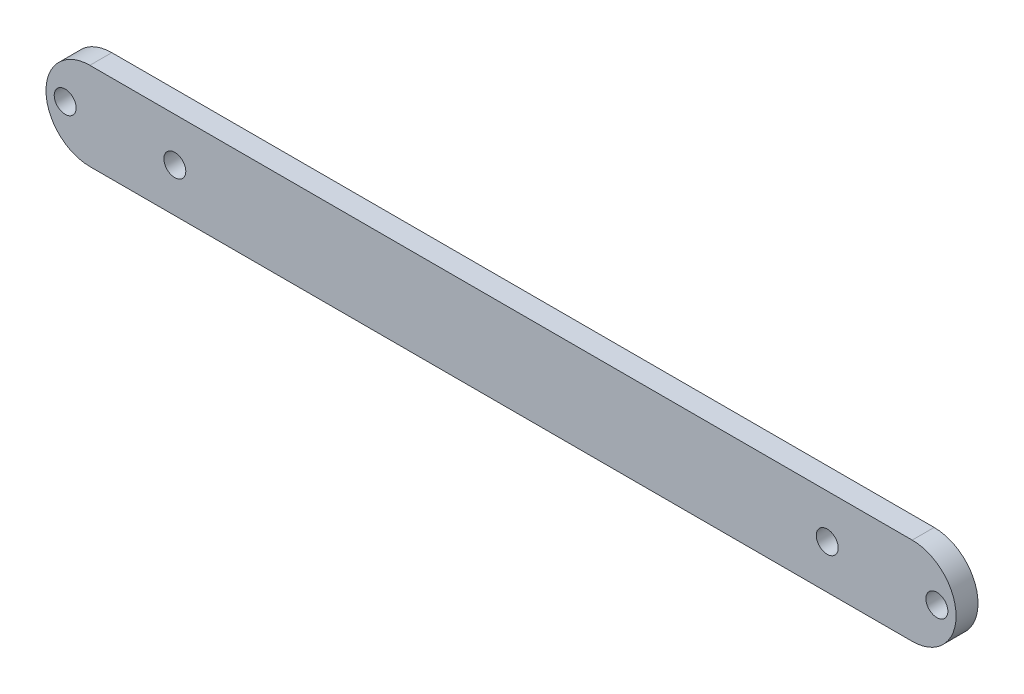
ISO-10303-21;
HEADER;
FILE_DESCRIPTION(('STEP AP214'),'2;1');
FILE_NAME('part.step','',(''),(''),'','','');
FILE_SCHEMA(('AUTOMOTIVE_DESIGN { 1 0 10303 214 1 1 1 1 }'));
ENDSEC;
DATA;
#1=APPLICATION_CONTEXT('core data for automotive mechanical design processes');
#2=APPLICATION_PROTOCOL_DEFINITION('international standard','automotive_design',2000,#1);
#3=PRODUCT_CONTEXT('',#1,'mechanical');
#4=PRODUCT('Part','Part','',(#3));
#5=PRODUCT_RELATED_PRODUCT_CATEGORY('part','',(#4));
#6=PRODUCT_DEFINITION_FORMATION('','',#4);
#7=PRODUCT_DEFINITION_CONTEXT('part definition',#1,'design');
#8=PRODUCT_DEFINITION('design','',#6,#7);
#9=PRODUCT_DEFINITION_SHAPE('','',#8);
#10=(LENGTH_UNIT() NAMED_UNIT(*) SI_UNIT(.MILLI.,.METRE.));
#11=(NAMED_UNIT(*) PLANE_ANGLE_UNIT() SI_UNIT($,.RADIAN.));
#12=(NAMED_UNIT(*) SI_UNIT($,.STERADIAN.) SOLID_ANGLE_UNIT());
#13=UNCERTAINTY_MEASURE_WITH_UNIT(LENGTH_MEASURE(1.E-05),#10,'distance_accuracy_value','');
#14=(GEOMETRIC_REPRESENTATION_CONTEXT(3) GLOBAL_UNCERTAINTY_ASSIGNED_CONTEXT((#13)) GLOBAL_UNIT_ASSIGNED_CONTEXT((#10,
#11,#12)) REPRESENTATION_CONTEXT('',''));
#15=CARTESIAN_POINT('',(0.,0.,0.));
#16=DIRECTION('',(0.,0.,1.));
#17=DIRECTION('',(1.,0.,0.));
#18=AXIS2_PLACEMENT_3D('',#15,#16,#17);
#19=CARTESIAN_POINT('',(0.,0.,4.));
#20=DIRECTION('',(0.,0.,-1.));
#21=DIRECTION('',(-1.,0.,0.));
#22=AXIS2_PLACEMENT_3D('',#19,#20,#21);
#23=CYLINDRICAL_SURFACE('',#22,8.);
#24=CARTESIAN_POINT('',(0.,0.,0.));
#25=DIRECTION('',(0.,0.,1.));
#26=DIRECTION('',(1.,0.,0.));
#27=AXIS2_PLACEMENT_3D('',#24,#25,#26);
#28=CIRCLE('',#27,8.);
#29=CARTESIAN_POINT('',(0.,8.,0.));
#30=VERTEX_POINT('',#29);
#31=CARTESIAN_POINT('',(0.,-8.,0.));
#32=VERTEX_POINT('',#31);
#33=EDGE_CURVE('E103',#30,#32,#28,.T.);
#34=ORIENTED_EDGE('',*,*,#33,.T.);
#35=DIRECTION('',(0.,0.,-1.));
#36=VECTOR('',#35,1.);
#37=CARTESIAN_POINT('',(0.,-8.,4.));
#38=LINE('',#37,#36);
#39=CARTESIAN_POINT('',(0.,-8.,4.));
#40=VERTEX_POINT('',#39);
#41=EDGE_CURVE('E11',#40,#32,#38,.T.);
#42=ORIENTED_EDGE('',*,*,#41,.F.);
#43=CARTESIAN_POINT('',(0.,0.,4.));
#44=DIRECTION('',(0.,0.,1.));
#45=DIRECTION('',(1.,0.,0.));
#46=AXIS2_PLACEMENT_3D('',#43,#44,#45);
#47=CIRCLE('',#46,8.);
#48=CARTESIAN_POINT('',(0.,8.,4.));
#49=VERTEX_POINT('',#48);
#50=EDGE_CURVE('E90',#49,#40,#47,.T.);
#51=ORIENTED_EDGE('',*,*,#50,.F.);
#52=DIRECTION('',(0.,0.,-1.));
#53=VECTOR('',#52,1.);
#54=CARTESIAN_POINT('',(0.,8.,4.));
#55=LINE('',#54,#53);
#56=EDGE_CURVE('E99',#49,#30,#55,.T.);
#57=ORIENTED_EDGE('',*,*,#56,.T.);
#58=EDGE_LOOP('',(#34,#42,#51,#57));
#59=FACE_BOUND('',#58,.T.);
#60=ADVANCED_FACE('F37',(#59),#23,.T.);
#61=CARTESIAN_POINT('',(0.,-8.,4.));
#62=DIRECTION('',(0.,1.,0.));
#63=DIRECTION('',(0.,0.,1.));
#64=AXIS2_PLACEMENT_3D('',#61,#62,#63);
#65=PLANE('',#64);
#66=DIRECTION('',(1.,0.,0.));
#67=VECTOR('',#66,1.);
#68=CARTESIAN_POINT('',(0.,-8.,0.));
#69=LINE('',#68,#67);
#70=CARTESIAN_POINT('',(150.,-8.,0.));
#71=VERTEX_POINT('',#70);
#72=EDGE_CURVE('E94',#32,#71,#69,.T.);
#73=ORIENTED_EDGE('',*,*,#72,.T.);
#74=DIRECTION('',(0.,0.,-1.));
#75=VECTOR('',#74,1.);
#76=CARTESIAN_POINT('',(150.,-8.,4.));
#77=LINE('',#76,#75);
#78=CARTESIAN_POINT('',(150.,-8.,4.));
#79=VERTEX_POINT('',#78);
#80=EDGE_CURVE('E46',#79,#71,#77,.T.);
#81=ORIENTED_EDGE('',*,*,#80,.F.);
#82=DIRECTION('',(1.,0.,0.));
#83=VECTOR('',#82,1.);
#84=CARTESIAN_POINT('',(0.,-8.,4.));
#85=LINE('',#84,#83);
#86=EDGE_CURVE('E85',#40,#79,#85,.T.);
#87=ORIENTED_EDGE('',*,*,#86,.F.);
#88=ORIENTED_EDGE('',*,*,#41,.T.);
#89=EDGE_LOOP('',(#73,#81,#87,#88));
#90=FACE_BOUND('',#89,.T.);
#91=ADVANCED_FACE('F93',(#90),#65,.F.);
#92=CARTESIAN_POINT('',(150.,0.,4.));
#93=DIRECTION('',(0.,0.,-1.));
#94=DIRECTION('',(-1.,0.,0.));
#95=AXIS2_PLACEMENT_3D('',#92,#93,#94);
#96=CYLINDRICAL_SURFACE('',#95,8.);
#97=CARTESIAN_POINT('',(150.,0.,0.));
#98=DIRECTION('',(0.,0.,1.));
#99=DIRECTION('',(1.,0.,0.));
#100=AXIS2_PLACEMENT_3D('',#97,#98,#99);
#101=CIRCLE('',#100,8.);
#102=CARTESIAN_POINT('',(150.,8.,0.));
#103=VERTEX_POINT('',#102);
#104=EDGE_CURVE('E72',#71,#103,#101,.T.);
#105=ORIENTED_EDGE('',*,*,#104,.T.);
#106=DIRECTION('',(0.,0.,-1.));
#107=VECTOR('',#106,1.);
#108=CARTESIAN_POINT('',(150.,8.,4.));
#109=LINE('',#108,#107);
#110=CARTESIAN_POINT('',(150.,8.,4.));
#111=VERTEX_POINT('',#110);
#112=EDGE_CURVE('E95',#111,#103,#109,.T.);
#113=ORIENTED_EDGE('',*,*,#112,.F.);
#114=CARTESIAN_POINT('',(150.,0.,4.));
#115=DIRECTION('',(0.,0.,1.));
#116=DIRECTION('',(1.,0.,0.));
#117=AXIS2_PLACEMENT_3D('',#114,#115,#116);
#118=CIRCLE('',#117,8.);
#119=EDGE_CURVE('E88',#79,#111,#118,.T.);
#120=ORIENTED_EDGE('',*,*,#119,.F.);
#121=ORIENTED_EDGE('',*,*,#80,.T.);
#122=EDGE_LOOP('',(#105,#113,#120,#121));
#123=FACE_BOUND('',#122,.T.);
#124=ADVANCED_FACE('F97',(#123),#96,.T.);
#125=CARTESIAN_POINT('',(0.,8.,4.));
#126=DIRECTION('',(0.,-1.,0.));
#127=DIRECTION('',(0.,0.,-1.));
#128=AXIS2_PLACEMENT_3D('',#125,#126,#127);
#129=PLANE('',#128);
#130=DIRECTION('',(-1.,0.,0.));
#131=VECTOR('',#130,1.);
#132=CARTESIAN_POINT('',(0.,8.,0.));
#133=LINE('',#132,#131);
#134=EDGE_CURVE('E78',#103,#30,#133,.T.);
#135=ORIENTED_EDGE('',*,*,#134,.T.);
#136=ORIENTED_EDGE('',*,*,#56,.F.);
#137=DIRECTION('',(-1.,0.,0.));
#138=VECTOR('',#137,1.);
#139=CARTESIAN_POINT('',(0.,8.,4.));
#140=LINE('',#139,#138);
#141=EDGE_CURVE('E55',#111,#49,#140,.T.);
#142=ORIENTED_EDGE('',*,*,#141,.F.);
#143=ORIENTED_EDGE('',*,*,#112,.T.);
#144=EDGE_LOOP('',(#135,#136,#142,#143));
#145=FACE_BOUND('',#144,.T.);
#146=ADVANCED_FACE('F154',(#145),#129,.F.);
#147=CARTESIAN_POINT('',(0.,0.,4.));
#148=DIRECTION('',(0.,0.,1.));
#149=DIRECTION('',(1.,0.,0.));
#150=AXIS2_PLACEMENT_3D('',#147,#148,#149);
#151=PLANE('',#150);
#152=CARTESIAN_POINT('',(154.5,0.,4.));
#153=DIRECTION('',(0.,0.,1.));
#154=DIRECTION('',(-1.,0.,0.));
#155=AXIS2_PLACEMENT_3D('',#152,#153,#154);
#156=CIRCLE('',#155,2.);
#157=CARTESIAN_POINT('',(152.5,0.,4.));
#158=VERTEX_POINT('',#157);
#159=EDGE_CURVE('E253',#158,#158,#156,.T.);
#160=ORIENTED_EDGE('',*,*,#159,.F.);
#161=EDGE_LOOP('',(#160));
#162=FACE_BOUND('',#161,.T.);
#163=CARTESIAN_POINT('',(-4.5,0.,4.));
#164=DIRECTION('',(0.,0.,1.));
#165=DIRECTION('',(1.,0.,0.));
#166=AXIS2_PLACEMENT_3D('',#163,#164,#165);
#167=CIRCLE('',#166,2.);
#168=CARTESIAN_POINT('',(-2.5,0.,4.));
#169=VERTEX_POINT('',#168);
#170=EDGE_CURVE('E248',#169,#169,#167,.T.);
#171=ORIENTED_EDGE('',*,*,#170,.F.);
#172=EDGE_LOOP('',(#171));
#173=FACE_BOUND('',#172,.T.);
#174=CARTESIAN_POINT('',(134.5,0.,4.));
#175=DIRECTION('',(0.,0.,1.));
#176=DIRECTION('',(1.,0.,0.));
#177=AXIS2_PLACEMENT_3D('',#174,#175,#176);
#178=CIRCLE('',#177,2.);
#179=CARTESIAN_POINT('',(136.5,0.,4.));
#180=VERTEX_POINT('',#179);
#181=EDGE_CURVE('E241',#180,#180,#178,.T.);
#182=ORIENTED_EDGE('',*,*,#181,.F.);
#183=EDGE_LOOP('',(#182));
#184=FACE_BOUND('',#183,.T.);
#185=CARTESIAN_POINT('',(15.5,0.,4.));
#186=DIRECTION('',(0.,0.,1.));
#187=DIRECTION('',(1.,0.,0.));
#188=AXIS2_PLACEMENT_3D('',#185,#186,#187);
#189=CIRCLE('',#188,2.);
#190=CARTESIAN_POINT('',(17.5,0.,4.));
#191=VERTEX_POINT('',#190);
#192=EDGE_CURVE('E115',#191,#191,#189,.T.);
#193=ORIENTED_EDGE('',*,*,#192,.F.);
#194=EDGE_LOOP('',(#193));
#195=FACE_BOUND('',#194,.T.);
#196=ORIENTED_EDGE('',*,*,#50,.T.);
#197=ORIENTED_EDGE('',*,*,#86,.T.);
#198=ORIENTED_EDGE('',*,*,#119,.T.);
#199=ORIENTED_EDGE('',*,*,#141,.T.);
#200=EDGE_LOOP('',(#196,#197,#198,#199));
#201=FACE_BOUND('',#200,.T.);
#202=ADVANCED_FACE('F86',(#162,#173,#184,#195,#201),#151,.T.);
#203=CARTESIAN_POINT('',(0.,0.,0.));
#204=DIRECTION('',(0.,0.,1.));
#205=DIRECTION('',(1.,0.,0.));
#206=AXIS2_PLACEMENT_3D('',#203,#204,#205);
#207=PLANE('',#206);
#208=CARTESIAN_POINT('',(154.5,0.,0.));
#209=DIRECTION('',(0.,0.,1.));
#210=DIRECTION('',(1.,0.,0.));
#211=AXIS2_PLACEMENT_3D('',#208,#209,#210);
#212=CIRCLE('',#211,2.);
#213=CARTESIAN_POINT('',(156.5,0.,0.));
#214=VERTEX_POINT('',#213);
#215=EDGE_CURVE('E40',#214,#214,#212,.T.);
#216=ORIENTED_EDGE('',*,*,#215,.T.);
#217=EDGE_LOOP('',(#216));
#218=FACE_BOUND('',#217,.T.);
#219=CARTESIAN_POINT('',(-4.5,0.,0.));
#220=DIRECTION('',(0.,0.,1.));
#221=DIRECTION('',(1.,0.,0.));
#222=AXIS2_PLACEMENT_3D('',#219,#220,#221);
#223=CIRCLE('',#222,2.);
#224=CARTESIAN_POINT('',(-2.5,0.,0.));
#225=VERTEX_POINT('',#224);
#226=EDGE_CURVE('E117',#225,#225,#223,.T.);
#227=ORIENTED_EDGE('',*,*,#226,.T.);
#228=EDGE_LOOP('',(#227));
#229=FACE_BOUND('',#228,.T.);
#230=CARTESIAN_POINT('',(134.5,0.,0.));
#231=DIRECTION('',(0.,0.,1.));
#232=DIRECTION('',(1.,0.,0.));
#233=AXIS2_PLACEMENT_3D('',#230,#231,#232);
#234=CIRCLE('',#233,2.);
#235=CARTESIAN_POINT('',(136.5,0.,0.));
#236=VERTEX_POINT('',#235);
#237=EDGE_CURVE('E114',#236,#236,#234,.T.);
#238=ORIENTED_EDGE('',*,*,#237,.T.);
#239=EDGE_LOOP('',(#238));
#240=FACE_BOUND('',#239,.T.);
#241=CARTESIAN_POINT('',(15.5,0.,0.));
#242=DIRECTION('',(0.,0.,1.));
#243=DIRECTION('',(1.,0.,0.));
#244=AXIS2_PLACEMENT_3D('',#241,#242,#243);
#245=CIRCLE('',#244,2.);
#246=CARTESIAN_POINT('',(17.5,0.,0.));
#247=VERTEX_POINT('',#246);
#248=EDGE_CURVE('E111',#247,#247,#245,.T.);
#249=ORIENTED_EDGE('',*,*,#248,.T.);
#250=EDGE_LOOP('',(#249));
#251=FACE_BOUND('',#250,.T.);
#252=ORIENTED_EDGE('',*,*,#33,.F.);
#253=ORIENTED_EDGE('',*,*,#134,.F.);
#254=ORIENTED_EDGE('',*,*,#104,.F.);
#255=ORIENTED_EDGE('',*,*,#72,.F.);
#256=EDGE_LOOP('',(#252,#253,#254,#255));
#257=FACE_BOUND('',#256,.T.);
#258=ADVANCED_FACE('F124',(#218,#229,#240,#251,#257),#207,.F.);
#259=CARTESIAN_POINT('',(15.5,0.,-6.));
#260=DIRECTION('',(0.,0.,1.));
#261=DIRECTION('',(1.,0.,0.));
#262=AXIS2_PLACEMENT_3D('',#259,#260,#261);
#263=CYLINDRICAL_SURFACE('',#262,2.);
#264=ORIENTED_EDGE('',*,*,#192,.T.);
#265=EDGE_LOOP('',(#264));
#266=FACE_BOUND('',#265,.T.);
#267=ORIENTED_EDGE('',*,*,#248,.F.);
#268=EDGE_LOOP('',(#267));
#269=FACE_BOUND('',#268,.T.);
#270=ADVANCED_FACE('F147',(#266,#269),#263,.F.);
#271=CARTESIAN_POINT('',(134.5,0.,-6.));
#272=DIRECTION('',(0.,0.,1.));
#273=DIRECTION('',(1.,0.,0.));
#274=AXIS2_PLACEMENT_3D('',#271,#272,#273);
#275=CYLINDRICAL_SURFACE('',#274,2.);
#276=ORIENTED_EDGE('',*,*,#181,.T.);
#277=EDGE_LOOP('',(#276));
#278=FACE_BOUND('',#277,.T.);
#279=ORIENTED_EDGE('',*,*,#237,.F.);
#280=EDGE_LOOP('',(#279));
#281=FACE_BOUND('',#280,.T.);
#282=ADVANCED_FACE('F134',(#278,#281),#275,.F.);
#283=CARTESIAN_POINT('',(-4.5,0.,-6.));
#284=DIRECTION('',(0.,0.,1.));
#285=DIRECTION('',(1.,0.,0.));
#286=AXIS2_PLACEMENT_3D('',#283,#284,#285);
#287=CYLINDRICAL_SURFACE('',#286,2.);
#288=ORIENTED_EDGE('',*,*,#170,.T.);
#289=EDGE_LOOP('',(#288));
#290=FACE_BOUND('',#289,.T.);
#291=ORIENTED_EDGE('',*,*,#226,.F.);
#292=EDGE_LOOP('',(#291));
#293=FACE_BOUND('',#292,.T.);
#294=ADVANCED_FACE('F128',(#290,#293),#287,.F.);
#295=CARTESIAN_POINT('',(154.5,0.,-6.));
#296=DIRECTION('',(0.,0.,1.));
#297=DIRECTION('',(1.,0.,0.));
#298=AXIS2_PLACEMENT_3D('',#295,#296,#297);
#299=CYLINDRICAL_SURFACE('',#298,2.);
#300=ORIENTED_EDGE('',*,*,#159,.T.);
#301=EDGE_LOOP('',(#300));
#302=FACE_BOUND('',#301,.T.);
#303=ORIENTED_EDGE('',*,*,#215,.F.);
#304=EDGE_LOOP('',(#303));
#305=FACE_BOUND('',#304,.T.);
#306=ADVANCED_FACE('F126',(#302,#305),#299,.F.);
#307=CLOSED_SHELL('',(#60,#91,#124,#146,#202,#258,#270,#282,#294,#306));
#308=MANIFOLD_SOLID_BREP('B2',#307);
#309=ADVANCED_BREP_SHAPE_REPRESENTATION('',(#18,#308),#14);
#310=SHAPE_DEFINITION_REPRESENTATION(#9,#309);
ENDSEC;
END-ISO-10303-21;
